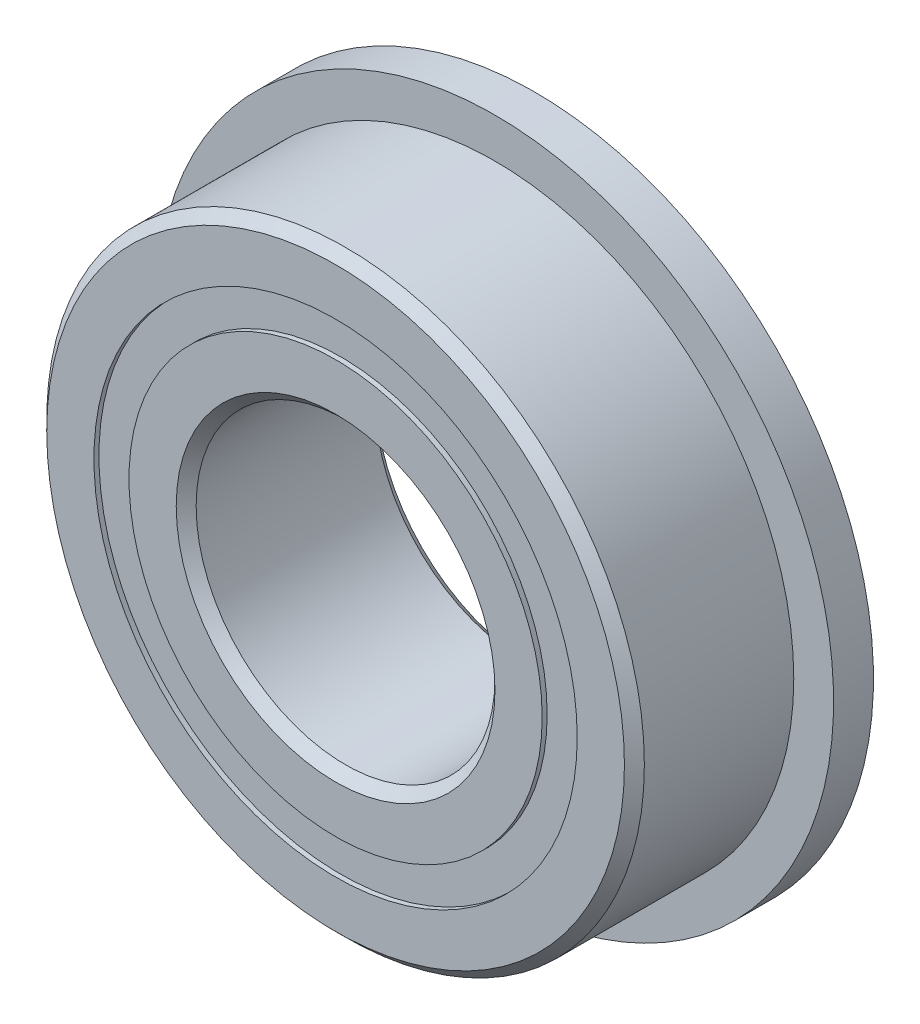
ISO-10303-21;
HEADER;
FILE_DESCRIPTION(('STEP AP214'),'2;1');
FILE_NAME('part.step','',(''),(''),'','','');
FILE_SCHEMA(('AUTOMOTIVE_DESIGN { 1 0 10303 214 1 1 1 1 }'));
ENDSEC;
DATA;
#1=APPLICATION_CONTEXT('core data for automotive mechanical design processes');
#2=APPLICATION_PROTOCOL_DEFINITION('international standard','automotive_design',2000,#1);
#3=PRODUCT_CONTEXT('',#1,'mechanical');
#4=PRODUCT('Part','Part','',(#3));
#5=PRODUCT_RELATED_PRODUCT_CATEGORY('part','',(#4));
#6=PRODUCT_DEFINITION_FORMATION('','',#4);
#7=PRODUCT_DEFINITION_CONTEXT('part definition',#1,'design');
#8=PRODUCT_DEFINITION('design','',#6,#7);
#9=PRODUCT_DEFINITION_SHAPE('','',#8);
#10=(LENGTH_UNIT() NAMED_UNIT(*) SI_UNIT(.MILLI.,.METRE.));
#11=(NAMED_UNIT(*) PLANE_ANGLE_UNIT() SI_UNIT($,.RADIAN.));
#12=(NAMED_UNIT(*) SI_UNIT($,.STERADIAN.) SOLID_ANGLE_UNIT());
#13=UNCERTAINTY_MEASURE_WITH_UNIT(LENGTH_MEASURE(1.E-05),#10,'distance_accuracy_value','');
#14=(GEOMETRIC_REPRESENTATION_CONTEXT(3) GLOBAL_UNCERTAINTY_ASSIGNED_CONTEXT((#13)) GLOBAL_UNIT_ASSIGNED_CONTEXT((#10,
#11,#12)) REPRESENTATION_CONTEXT('',''));
#15=CARTESIAN_POINT('',(0.,0.,0.));
#16=DIRECTION('',(0.,0.,1.));
#17=DIRECTION('',(1.,0.,0.));
#18=AXIS2_PLACEMENT_3D('',#15,#16,#17);
#19=CARTESIAN_POINT('',(0.,4.85164835164835,-1.9));
#20=DIRECTION('',(0.,0.,1.));
#21=DIRECTION('',(1.,0.,0.));
#22=AXIS2_PLACEMENT_3D('',#19,#20,#21);
#23=PLANE('',#22);
#24=CARTESIAN_POINT('',(0.,0.,-1.9));
#25=DIRECTION('',(0.,0.,1.));
#26=DIRECTION('',(1.,0.,0.));
#27=AXIS2_PLACEMENT_3D('',#24,#25,#26);
#28=CIRCLE('',#27,4.85164835164835);
#29=CARTESIAN_POINT('',(4.85164835164835,0.,-1.9));
#30=VERTEX_POINT('',#29);
#31=EDGE_CURVE('E58',#30,#30,#28,.T.);
#32=ORIENTED_EDGE('',*,*,#31,.F.);
#33=EDGE_LOOP('',(#32));
#34=FACE_BOUND('',#33,.T.);
#35=CARTESIAN_POINT('',(0.,0.,-1.9));
#36=DIRECTION('',(0.,0.,1.));
#37=DIRECTION('',(1.,0.,0.));
#38=AXIS2_PLACEMENT_3D('',#35,#36,#37);
#39=CIRCLE('',#38,4.14835164835165);
#40=CARTESIAN_POINT('',(4.14835164835165,0.,-1.9));
#41=VERTEX_POINT('',#40);
#42=EDGE_CURVE('E11',#41,#41,#39,.T.);
#43=ORIENTED_EDGE('',*,*,#42,.T.);
#44=EDGE_LOOP('',(#43));
#45=FACE_BOUND('',#44,.T.);
#46=ADVANCED_FACE('F44',(#34,#45),#23,.F.);
#47=CARTESIAN_POINT('',(0.,0.,2.));
#48=DIRECTION('',(0.,0.,1.));
#49=DIRECTION('',(1.,0.,0.));
#50=AXIS2_PLACEMENT_3D('',#47,#48,#49);
#51=CYLINDRICAL_SURFACE('',#50,4.14835164835165);
#52=ORIENTED_EDGE('',*,*,#42,.F.);
#53=EDGE_LOOP('',(#52));
#54=FACE_BOUND('',#53,.T.);
#55=CARTESIAN_POINT('',(0.,0.,-0.955918417024762));
#56=DIRECTION('',(0.,0.,1.));
#57=DIRECTION('',(1.,0.,0.));
#58=AXIS2_PLACEMENT_3D('',#55,#56,#57);
#59=CIRCLE('',#58,4.14835164835165);
#60=CARTESIAN_POINT('',(4.14835164835165,0.,-0.955918417024762));
#61=VERTEX_POINT('',#60);
#62=EDGE_CURVE('E50',#61,#61,#59,.T.);
#63=ORIENTED_EDGE('',*,*,#62,.T.);
#64=EDGE_LOOP('',(#63));
#65=FACE_BOUND('',#64,.T.);
#66=ADVANCED_FACE('F67',(#54,#65),#51,.F.);
#67=CARTESIAN_POINT('',(0.,4.85164835164835,-0.955918417024762));
#68=DIRECTION('',(0.,0.,-1.));
#69=DIRECTION('',(-1.,0.,0.));
#70=AXIS2_PLACEMENT_3D('',#67,#68,#69);
#71=PLANE('',#70);
#72=ORIENTED_EDGE('',*,*,#62,.F.);
#73=EDGE_LOOP('',(#72));
#74=FACE_BOUND('',#73,.T.);
#75=CARTESIAN_POINT('',(0.,0.,-0.955918417024762));
#76=DIRECTION('',(0.,0.,1.));
#77=DIRECTION('',(1.,0.,0.));
#78=AXIS2_PLACEMENT_3D('',#75,#76,#77);
#79=CIRCLE('',#78,4.85164835164835);
#80=CARTESIAN_POINT('',(4.85164835164835,0.,-0.955918417024762));
#81=VERTEX_POINT('',#80);
#82=EDGE_CURVE('E54',#81,#81,#79,.T.);
#83=ORIENTED_EDGE('',*,*,#82,.T.);
#84=EDGE_LOOP('',(#83));
#85=FACE_BOUND('',#84,.T.);
#86=ADVANCED_FACE('F71',(#74,#85),#71,.F.);
#87=CARTESIAN_POINT('',(0.,0.,2.));
#88=DIRECTION('',(0.,0.,1.));
#89=DIRECTION('',(1.,0.,0.));
#90=AXIS2_PLACEMENT_3D('',#87,#88,#89);
#91=CYLINDRICAL_SURFACE('',#90,4.85164835164835);
#92=ORIENTED_EDGE('',*,*,#82,.F.);
#93=EDGE_LOOP('',(#92));
#94=FACE_BOUND('',#93,.T.);
#95=ORIENTED_EDGE('',*,*,#31,.T.);
#96=EDGE_LOOP('',(#95));
#97=FACE_BOUND('',#96,.T.);
#98=ADVANCED_FACE('F64',(#94,#97),#91,.T.);
#99=CLOSED_SHELL('',(#46,#66,#86,#98));
#100=MANIFOLD_SOLID_BREP('B2',#99);
#101=CARTESIAN_POINT('',(0.,4.85164835164835,1.9));
#102=DIRECTION('',(0.,0.,-1.));
#103=DIRECTION('',(-1.,0.,0.));
#104=AXIS2_PLACEMENT_3D('',#101,#102,#103);
#105=PLANE('',#104);
#106=CARTESIAN_POINT('',(0.,0.,1.9));
#107=DIRECTION('',(0.,0.,1.));
#108=DIRECTION('',(1.,0.,0.));
#109=AXIS2_PLACEMENT_3D('',#106,#107,#108);
#110=CIRCLE('',#109,4.14835164835165);
#111=CARTESIAN_POINT('',(4.14835164835165,0.,1.9));
#112=VERTEX_POINT('',#111);
#113=EDGE_CURVE('E43',#112,#112,#110,.T.);
#114=ORIENTED_EDGE('',*,*,#113,.F.);
#115=EDGE_LOOP('',(#114));
#116=FACE_BOUND('',#115,.T.);
#117=CARTESIAN_POINT('',(0.,0.,1.9));
#118=DIRECTION('',(0.,0.,1.));
#119=DIRECTION('',(1.,0.,0.));
#120=AXIS2_PLACEMENT_3D('',#117,#118,#119);
#121=CIRCLE('',#120,4.85164835164835);
#122=CARTESIAN_POINT('',(4.85164835164835,0.,1.9));
#123=VERTEX_POINT('',#122);
#124=EDGE_CURVE('E126',#123,#123,#121,.T.);
#125=ORIENTED_EDGE('',*,*,#124,.T.);
#126=EDGE_LOOP('',(#125));
#127=FACE_BOUND('',#126,.T.);
#128=ADVANCED_FACE('F112',(#116,#127),#105,.F.);
#129=CARTESIAN_POINT('',(0.,0.,2.));
#130=DIRECTION('',(0.,0.,1.));
#131=DIRECTION('',(1.,0.,0.));
#132=AXIS2_PLACEMENT_3D('',#129,#130,#131);
#133=CYLINDRICAL_SURFACE('',#132,4.14835164835165);
#134=CARTESIAN_POINT('',(0.,0.,0.955918417024761));
#135=DIRECTION('',(0.,0.,1.));
#136=DIRECTION('',(1.,0.,0.));
#137=AXIS2_PLACEMENT_3D('',#134,#135,#136);
#138=CIRCLE('',#137,4.14835164835165);
#139=CARTESIAN_POINT('',(4.14835164835165,0.,0.955918417024761));
#140=VERTEX_POINT('',#139);
#141=EDGE_CURVE('E118',#140,#140,#138,.T.);
#142=ORIENTED_EDGE('',*,*,#141,.F.);
#143=EDGE_LOOP('',(#142));
#144=FACE_BOUND('',#143,.T.);
#145=ORIENTED_EDGE('',*,*,#113,.T.);
#146=EDGE_LOOP('',(#145));
#147=FACE_BOUND('',#146,.T.);
#148=ADVANCED_FACE('F141',(#144,#147),#133,.F.);
#149=CARTESIAN_POINT('',(0.,4.85164835164835,0.955918417024761));
#150=DIRECTION('',(0.,0.,1.));
#151=DIRECTION('',(1.,0.,0.));
#152=AXIS2_PLACEMENT_3D('',#149,#150,#151);
#153=PLANE('',#152);
#154=CARTESIAN_POINT('',(0.,0.,0.955918417024761));
#155=DIRECTION('',(0.,0.,1.));
#156=DIRECTION('',(1.,0.,0.));
#157=AXIS2_PLACEMENT_3D('',#154,#155,#156);
#158=CIRCLE('',#157,4.85164835164835);
#159=CARTESIAN_POINT('',(4.85164835164835,0.,0.955918417024761));
#160=VERTEX_POINT('',#159);
#161=EDGE_CURVE('E122',#160,#160,#158,.T.);
#162=ORIENTED_EDGE('',*,*,#161,.F.);
#163=EDGE_LOOP('',(#162));
#164=FACE_BOUND('',#163,.T.);
#165=ORIENTED_EDGE('',*,*,#141,.T.);
#166=EDGE_LOOP('',(#165));
#167=FACE_BOUND('',#166,.T.);
#168=ADVANCED_FACE('F136',(#164,#167),#153,.F.);
#169=CARTESIAN_POINT('',(0.,0.,2.));
#170=DIRECTION('',(0.,0.,1.));
#171=DIRECTION('',(1.,0.,0.));
#172=AXIS2_PLACEMENT_3D('',#169,#170,#171);
#173=CYLINDRICAL_SURFACE('',#172,4.85164835164835);
#174=ORIENTED_EDGE('',*,*,#124,.F.);
#175=EDGE_LOOP('',(#174));
#176=FACE_BOUND('',#175,.T.);
#177=ORIENTED_EDGE('',*,*,#161,.T.);
#178=EDGE_LOOP('',(#177));
#179=FACE_BOUND('',#178,.T.);
#180=ADVANCED_FACE('F133',(#176,#179),#173,.T.);
#181=CLOSED_SHELL('',(#128,#148,#168,#180));
#182=MANIFOLD_SOLID_BREP('B6',#181);
#183=CARTESIAN_POINT('',(-2.24999999999995,3.89711431703,0.));
#184=DIRECTION('',(0.,0.,1.));
#185=DIRECTION('',(-0.499999999999989,0.866025403784445,0.));
#186=AXIS2_PLACEMENT_3D('',#183,#184,#185);
#187=SPHERICAL_SURFACE('',#186,0.955918417024761);
#188=CARTESIAN_POINT('',(-2.24999999999995,3.89711431703,0.955918417024761));
#189=VERTEX_POINT('',#188);
#190=VERTEX_LOOP('',#189);
#191=FACE_BOUND('',#190,.T.);
#192=ADVANCED_FACE('F180',(#191),#187,.T.);
#193=CLOSED_SHELL('',(#192));
#194=MANIFOLD_SOLID_BREP('B38',#193);
#195=CARTESIAN_POINT('',(-3.89711431702995,2.25000000000005,0.));
#196=DIRECTION('',(0.,0.,1.));
#197=DIRECTION('',(-0.866025403784433,0.50000000000001,0.));
#198=AXIS2_PLACEMENT_3D('',#195,#196,#197);
#199=SPHERICAL_SURFACE('',#198,0.955918417024761);
#200=CARTESIAN_POINT('',(-3.89711431702995,2.25000000000005,0.955918417024761));
#201=VERTEX_POINT('',#200);
#202=VERTEX_LOOP('',#201);
#203=FACE_BOUND('',#202,.T.);
#204=ADVANCED_FACE('F201',(#203),#199,.T.);
#205=CLOSED_SHELL('',(#204));
#206=MANIFOLD_SOLID_BREP('B108',#205);
#207=CARTESIAN_POINT('',(-4.5,0.,0.));
#208=DIRECTION('',(0.,0.,1.));
#209=DIRECTION('',(-1.,0.,0.));
#210=AXIS2_PLACEMENT_3D('',#207,#208,#209);
#211=SPHERICAL_SURFACE('',#210,0.955918417024761);
#212=CARTESIAN_POINT('',(-4.5,0.,0.955918417024761));
#213=VERTEX_POINT('',#212);
#214=VERTEX_LOOP('',#213);
#215=FACE_BOUND('',#214,.T.);
#216=ADVANCED_FACE('F222',(#215),#211,.T.);
#217=CLOSED_SHELL('',(#216));
#218=MANIFOLD_SOLID_BREP('B176',#217);
#219=CARTESIAN_POINT('',(-3.89711431703,-2.24999999999996,0.));
#220=DIRECTION('',(0.,0.,1.));
#221=DIRECTION('',(-0.866025403784443,-0.499999999999992,0.));
#222=AXIS2_PLACEMENT_3D('',#219,#220,#221);
#223=SPHERICAL_SURFACE('',#222,0.955918417024761);
#224=CARTESIAN_POINT('',(-3.89711431703,-2.24999999999996,0.955918417024761));
#225=VERTEX_POINT('',#224);
#226=VERTEX_LOOP('',#225);
#227=FACE_BOUND('',#226,.T.);
#228=ADVANCED_FACE('F243',(#227),#223,.T.);
#229=CLOSED_SHELL('',(#228));
#230=MANIFOLD_SOLID_BREP('B197',#229);
#231=CARTESIAN_POINT('',(-2.25000000000003,-3.89711431702996,0.));
#232=DIRECTION('',(0.,0.,1.));
#233=DIRECTION('',(-0.500000000000007,-0.866025403784435,0.));
#234=AXIS2_PLACEMENT_3D('',#231,#232,#233);
#235=SPHERICAL_SURFACE('',#234,0.955918417024761);
#236=CARTESIAN_POINT('',(-2.25000000000003,-3.89711431702996,0.955918417024761));
#237=VERTEX_POINT('',#236);
#238=VERTEX_LOOP('',#237);
#239=FACE_BOUND('',#238,.T.);
#240=ADVANCED_FACE('F264',(#239),#235,.T.);
#241=CLOSED_SHELL('',(#240));
#242=MANIFOLD_SOLID_BREP('B218',#241);
#243=CARTESIAN_POINT('',(0.,-4.5,0.));
#244=DIRECTION('',(0.,0.,1.));
#245=DIRECTION('',(0.,-1.,0.));
#246=AXIS2_PLACEMENT_3D('',#243,#244,#245);
#247=SPHERICAL_SURFACE('',#246,0.955918417024761);
#248=CARTESIAN_POINT('',(0.,-4.5,0.955918417024761));
#249=VERTEX_POINT('',#248);
#250=VERTEX_LOOP('',#249);
#251=FACE_BOUND('',#250,.T.);
#252=ADVANCED_FACE('F285',(#251),#247,.T.);
#253=CLOSED_SHELL('',(#252));
#254=MANIFOLD_SOLID_BREP('B239',#253);
#255=CARTESIAN_POINT('',(2.24999999999998,-3.89711431702999,0.));
#256=DIRECTION('',(0.,0.,1.));
#257=DIRECTION('',(0.499999999999995,-0.866025403784442,0.));
#258=AXIS2_PLACEMENT_3D('',#255,#256,#257);
#259=SPHERICAL_SURFACE('',#258,0.955918417024761);
#260=CARTESIAN_POINT('',(2.24999999999998,-3.89711431702999,0.955918417024761));
#261=VERTEX_POINT('',#260);
#262=VERTEX_LOOP('',#261);
#263=FACE_BOUND('',#262,.T.);
#264=ADVANCED_FACE('F306',(#263),#259,.T.);
#265=CLOSED_SHELL('',(#264));
#266=MANIFOLD_SOLID_BREP('B260',#265);
#267=CARTESIAN_POINT('',(3.89711431702996,-2.25000000000002,0.));
#268=DIRECTION('',(0.,0.,1.));
#269=DIRECTION('',(0.866025403784436,-0.500000000000004,0.));
#270=AXIS2_PLACEMENT_3D('',#267,#268,#269);
#271=SPHERICAL_SURFACE('',#270,0.955918417024761);
#272=CARTESIAN_POINT('',(3.89711431702996,-2.25000000000002,0.955918417024761));
#273=VERTEX_POINT('',#272);
#274=VERTEX_LOOP('',#273);
#275=FACE_BOUND('',#274,.T.);
#276=ADVANCED_FACE('F327',(#275),#271,.T.);
#277=CLOSED_SHELL('',(#276));
#278=MANIFOLD_SOLID_BREP('B281',#277);
#279=CARTESIAN_POINT('',(4.5,0.,0.));
#280=DIRECTION('',(0.,0.,1.));
#281=DIRECTION('',(1.,0.,0.));
#282=AXIS2_PLACEMENT_3D('',#279,#280,#281);
#283=SPHERICAL_SURFACE('',#282,0.955918417024761);
#284=CARTESIAN_POINT('',(4.5,0.,0.955918417024761));
#285=VERTEX_POINT('',#284);
#286=VERTEX_LOOP('',#285);
#287=FACE_BOUND('',#286,.T.);
#288=ADVANCED_FACE('F348',(#287),#283,.T.);
#289=CLOSED_SHELL('',(#288));
#290=MANIFOLD_SOLID_BREP('B302',#289);
#291=CARTESIAN_POINT('',(3.89711431702998,2.24999999999999,0.));
#292=DIRECTION('',(0.,0.,1.));
#293=DIRECTION('',(0.86602540378444,0.499999999999998,0.));
#294=AXIS2_PLACEMENT_3D('',#291,#292,#293);
#295=SPHERICAL_SURFACE('',#294,0.955918417024761);
#296=CARTESIAN_POINT('',(3.89711431702998,2.24999999999999,0.955918417024761));
#297=VERTEX_POINT('',#296);
#298=VERTEX_LOOP('',#297);
#299=FACE_BOUND('',#298,.T.);
#300=ADVANCED_FACE('F369',(#299),#295,.T.);
#301=CLOSED_SHELL('',(#300));
#302=MANIFOLD_SOLID_BREP('B323',#301);
#303=CARTESIAN_POINT('',(2.25,3.89711431702997,0.));
#304=DIRECTION('',(0.,0.,1.));
#305=DIRECTION('',(0.500000000000001,0.866025403784438,0.));
#306=AXIS2_PLACEMENT_3D('',#303,#304,#305);
#307=SPHERICAL_SURFACE('',#306,0.955918417024761);
#308=CARTESIAN_POINT('',(2.25,3.89711431702997,0.955918417024761));
#309=VERTEX_POINT('',#308);
#310=VERTEX_LOOP('',#309);
#311=FACE_BOUND('',#310,.T.);
#312=ADVANCED_FACE('F390',(#311),#307,.T.);
#313=CLOSED_SHELL('',(#312));
#314=MANIFOLD_SOLID_BREP('B344',#313);
#315=CARTESIAN_POINT('',(0.,4.5,0.));
#316=DIRECTION('',(0.,0.,1.));
#317=DIRECTION('',(0.,1.,0.));
#318=AXIS2_PLACEMENT_3D('',#315,#316,#317);
#319=SPHERICAL_SURFACE('',#318,0.955918417024761);
#320=CARTESIAN_POINT('',(0.,4.5,0.955918417024761));
#321=VERTEX_POINT('',#320);
#322=VERTEX_LOOP('',#321);
#323=FACE_BOUND('',#322,.T.);
#324=ADVANCED_FACE('F413',(#323),#319,.T.);
#325=CLOSED_SHELL('',(#324));
#326=MANIFOLD_SOLID_BREP('B365',#325);
#327=CARTESIAN_POINT('',(0.,4.14835164835165,2.));
#328=DIRECTION('',(0.,0.,-1.));
#329=DIRECTION('',(-1.,0.,0.));
#330=AXIS2_PLACEMENT_3D('',#327,#328,#329);
#331=PLANE('',#330);
#332=CARTESIAN_POINT('',(0.,0.,2.));
#333=DIRECTION('',(0.,0.,1.));
#334=DIRECTION('',(1.,0.,0.));
#335=AXIS2_PLACEMENT_3D('',#332,#333,#334);
#336=CIRCLE('',#335,3.2);
#337=CARTESIAN_POINT('',(3.2,0.,2.));
#338=VERTEX_POINT('',#337);
#339=EDGE_CURVE('E461',#338,#338,#336,.T.);
#340=ORIENTED_EDGE('',*,*,#339,.F.);
#341=EDGE_LOOP('',(#340));
#342=FACE_BOUND('',#341,.T.);
#343=CARTESIAN_POINT('',(0.,0.,2.));
#344=DIRECTION('',(0.,0.,1.));
#345=DIRECTION('',(1.,0.,0.));
#346=AXIS2_PLACEMENT_3D('',#343,#344,#345);
#347=CIRCLE('',#346,4.14835164835165);
#348=CARTESIAN_POINT('',(4.14835164835165,0.,2.));
#349=VERTEX_POINT('',#348);
#350=EDGE_CURVE('E412',#349,#349,#347,.T.);
#351=ORIENTED_EDGE('',*,*,#350,.T.);
#352=EDGE_LOOP('',(#351));
#353=FACE_BOUND('',#352,.T.);
#354=ADVANCED_FACE('F433',(#342,#353),#331,.F.);
#355=CARTESIAN_POINT('',(0.,0.,2.));
#356=DIRECTION('',(0.,0.,1.));
#357=DIRECTION('',(1.,0.,0.));
#358=AXIS2_PLACEMENT_3D('',#355,#356,#357);
#359=CYLINDRICAL_SURFACE('',#358,4.14835164835165);
#360=ORIENTED_EDGE('',*,*,#350,.F.);
#361=EDGE_LOOP('',(#360));
#362=FACE_BOUND('',#361,.T.);
#363=CARTESIAN_POINT('',(0.,0.,0.888888888888888));
#364=DIRECTION('',(0.,0.,1.));
#365=DIRECTION('',(1.,0.,0.));
#366=AXIS2_PLACEMENT_3D('',#363,#364,#365);
#367=CIRCLE('',#366,4.14835164835165);
#368=CARTESIAN_POINT('',(4.14835164835165,0.,0.888888888888888));
#369=VERTEX_POINT('',#368);
#370=EDGE_CURVE('E439',#369,#369,#367,.T.);
#371=ORIENTED_EDGE('',*,*,#370,.T.);
#372=EDGE_LOOP('',(#371));
#373=FACE_BOUND('',#372,.T.);
#374=ADVANCED_FACE('F468',(#362,#373),#359,.T.);
#375=CARTESIAN_POINT('',(0.,0.,0.));
#376=DIRECTION('',(0.,0.,1.));
#377=DIRECTION('',(1.,0.,0.));
#378=AXIS2_PLACEMENT_3D('',#375,#376,#377);
#379=TOROIDAL_SURFACE('',#378,4.5,0.95591841702476);
#380=ORIENTED_EDGE('',*,*,#370,.F.);
#381=EDGE_LOOP('',(#380));
#382=FACE_BOUND('',#381,.T.);
#383=CARTESIAN_POINT('',(0.,0.,-0.88888888888889));
#384=DIRECTION('',(0.,0.,1.));
#385=DIRECTION('',(1.,0.,0.));
#386=AXIS2_PLACEMENT_3D('',#383,#384,#385);
#387=CIRCLE('',#386,4.14835164835165);
#388=CARTESIAN_POINT('',(4.14835164835165,0.,-0.88888888888889));
#389=VERTEX_POINT('',#388);
#390=EDGE_CURVE('E443',#389,#389,#387,.T.);
#391=ORIENTED_EDGE('',*,*,#390,.T.);
#392=EDGE_LOOP('',(#391));
#393=FACE_BOUND('',#392,.T.);
#394=ADVANCED_FACE('F472',(#382,#393),#379,.F.);
#395=CARTESIAN_POINT('',(0.,0.,2.));
#396=DIRECTION('',(0.,0.,1.));
#397=DIRECTION('',(1.,0.,0.));
#398=AXIS2_PLACEMENT_3D('',#395,#396,#397);
#399=CYLINDRICAL_SURFACE('',#398,4.14835164835165);
#400=ORIENTED_EDGE('',*,*,#390,.F.);
#401=EDGE_LOOP('',(#400));
#402=FACE_BOUND('',#401,.T.);
#403=CARTESIAN_POINT('',(0.,0.,-2.));
#404=DIRECTION('',(0.,0.,1.));
#405=DIRECTION('',(1.,0.,0.));
#406=AXIS2_PLACEMENT_3D('',#403,#404,#405);
#407=CIRCLE('',#406,4.14835164835165);
#408=CARTESIAN_POINT('',(4.14835164835165,0.,-2.));
#409=VERTEX_POINT('',#408);
#410=EDGE_CURVE('E447',#409,#409,#407,.T.);
#411=ORIENTED_EDGE('',*,*,#410,.T.);
#412=EDGE_LOOP('',(#411));
#413=FACE_BOUND('',#412,.T.);
#414=ADVANCED_FACE('F477',(#402,#413),#399,.T.);
#415=CARTESIAN_POINT('',(0.,3.2,-2.));
#416=DIRECTION('',(0.,0.,1.));
#417=DIRECTION('',(1.,0.,0.));
#418=AXIS2_PLACEMENT_3D('',#415,#416,#417);
#419=PLANE('',#418);
#420=ORIENTED_EDGE('',*,*,#410,.F.);
#421=EDGE_LOOP('',(#420));
#422=FACE_BOUND('',#421,.T.);
#423=CARTESIAN_POINT('',(0.,0.,-2.));
#424=DIRECTION('',(0.,0.,1.));
#425=DIRECTION('',(1.,0.,0.));
#426=AXIS2_PLACEMENT_3D('',#423,#424,#425);
#427=CIRCLE('',#426,3.2);
#428=CARTESIAN_POINT('',(3.2,0.,-2.));
#429=VERTEX_POINT('',#428);
#430=EDGE_CURVE('E452',#429,#429,#427,.T.);
#431=ORIENTED_EDGE('',*,*,#430,.T.);
#432=EDGE_LOOP('',(#431));
#433=FACE_BOUND('',#432,.T.);
#434=ADVANCED_FACE('F483',(#422,#433),#419,.F.);
#435=CARTESIAN_POINT('',(0.,0.,-1.8));
#436=DIRECTION('',(0.,0.,-1.));
#437=DIRECTION('',(-1.,0.,0.));
#438=AXIS2_PLACEMENT_3D('',#435,#436,#437);
#439=CONICAL_SURFACE('',#438,3.,0.785398163397443);
#440=ORIENTED_EDGE('',*,*,#430,.F.);
#441=EDGE_LOOP('',(#440));
#442=FACE_BOUND('',#441,.T.);
#443=CARTESIAN_POINT('',(0.,0.,-1.8));
#444=DIRECTION('',(0.,0.,1.));
#445=DIRECTION('',(1.,0.,0.));
#446=AXIS2_PLACEMENT_3D('',#443,#444,#445);
#447=CIRCLE('',#446,3.);
#448=CARTESIAN_POINT('',(3.,0.,-1.8));
#449=VERTEX_POINT('',#448);
#450=EDGE_CURVE('E455',#449,#449,#447,.T.);
#451=ORIENTED_EDGE('',*,*,#450,.T.);
#452=EDGE_LOOP('',(#451));
#453=FACE_BOUND('',#452,.T.);
#454=ADVANCED_FACE('F487',(#442,#453),#439,.F.);
#455=CARTESIAN_POINT('',(0.,0.,2.));
#456=DIRECTION('',(0.,0.,1.));
#457=DIRECTION('',(1.,0.,0.));
#458=AXIS2_PLACEMENT_3D('',#455,#456,#457);
#459=CYLINDRICAL_SURFACE('',#458,3.);
#460=ORIENTED_EDGE('',*,*,#450,.F.);
#461=EDGE_LOOP('',(#460));
#462=FACE_BOUND('',#461,.T.);
#463=CARTESIAN_POINT('',(0.,0.,1.8));
#464=DIRECTION('',(0.,0.,1.));
#465=DIRECTION('',(1.,0.,0.));
#466=AXIS2_PLACEMENT_3D('',#463,#464,#465);
#467=CIRCLE('',#466,3.);
#468=CARTESIAN_POINT('',(3.,0.,1.8));
#469=VERTEX_POINT('',#468);
#470=EDGE_CURVE('E458',#469,#469,#467,.T.);
#471=ORIENTED_EDGE('',*,*,#470,.T.);
#472=EDGE_LOOP('',(#471));
#473=FACE_BOUND('',#472,.T.);
#474=ADVANCED_FACE('F491',(#462,#473),#459,.F.);
#475=CARTESIAN_POINT('',(0.,0.,2.));
#476=DIRECTION('',(0.,0.,1.));
#477=DIRECTION('',(1.,0.,0.));
#478=AXIS2_PLACEMENT_3D('',#475,#476,#477);
#479=CONICAL_SURFACE('',#478,3.2,0.78539816339745);
#480=ORIENTED_EDGE('',*,*,#470,.F.);
#481=EDGE_LOOP('',(#480));
#482=FACE_BOUND('',#481,.T.);
#483=ORIENTED_EDGE('',*,*,#339,.T.);
#484=EDGE_LOOP('',(#483));
#485=FACE_BOUND('',#484,.T.);
#486=ADVANCED_FACE('F465',(#482,#485),#479,.F.);
#487=CLOSED_SHELL('',(#354,#374,#394,#414,#434,#454,#474,#486));
#488=MANIFOLD_SOLID_BREP('B386',#487);
#489=CARTESIAN_POINT('',(0.,0.,1.8));
#490=DIRECTION('',(0.,0.,-1.));
#491=DIRECTION('',(-1.,0.,0.));
#492=AXIS2_PLACEMENT_3D('',#489,#490,#491);
#493=CONICAL_SURFACE('',#492,6.,0.785398163397447);
#494=CARTESIAN_POINT('',(0.,0.,2.));
#495=DIRECTION('',(0.,0.,1.));
#496=DIRECTION('',(1.,0.,0.));
#497=AXIS2_PLACEMENT_3D('',#494,#495,#496);
#498=CIRCLE('',#497,5.8);
#499=CARTESIAN_POINT('',(5.8,0.,2.));
#500=VERTEX_POINT('',#499);
#501=EDGE_CURVE('E577',#500,#500,#498,.T.);
#502=ORIENTED_EDGE('',*,*,#501,.F.);
#503=EDGE_LOOP('',(#502));
#504=FACE_BOUND('',#503,.T.);
#505=CARTESIAN_POINT('',(0.,0.,1.8));
#506=DIRECTION('',(0.,0.,1.));
#507=DIRECTION('',(1.,0.,0.));
#508=AXIS2_PLACEMENT_3D('',#505,#506,#507);
#509=CIRCLE('',#508,6.);
#510=CARTESIAN_POINT('',(6.,0.,1.8));
#511=VERTEX_POINT('',#510);
#512=EDGE_CURVE('E432',#511,#511,#509,.T.);
#513=ORIENTED_EDGE('',*,*,#512,.T.);
#514=EDGE_LOOP('',(#513));
#515=FACE_BOUND('',#514,.T.);
#516=ADVANCED_FACE('F555',(#504,#515),#493,.T.);
#517=CARTESIAN_POINT('',(0.,0.,2.));
#518=DIRECTION('',(0.,0.,1.));
#519=DIRECTION('',(1.,0.,0.));
#520=AXIS2_PLACEMENT_3D('',#517,#518,#519);
#521=CYLINDRICAL_SURFACE('',#520,6.);
#522=CARTESIAN_POINT('',(0.,0.,-1.2));
#523=DIRECTION('',(0.,0.,1.));
#524=DIRECTION('',(1.,0.,0.));
#525=AXIS2_PLACEMENT_3D('',#522,#523,#524);
#526=CIRCLE('',#525,6.);
#527=CARTESIAN_POINT('',(6.,0.,-1.2));
#528=VERTEX_POINT('',#527);
#529=EDGE_CURVE('E580',#528,#528,#526,.T.);
#530=ORIENTED_EDGE('',*,*,#529,.T.);
#531=EDGE_LOOP('',(#530));
#532=FACE_BOUND('',#531,.T.);
#533=ORIENTED_EDGE('',*,*,#512,.F.);
#534=EDGE_LOOP('',(#533));
#535=FACE_BOUND('',#534,.T.);
#536=ADVANCED_FACE('F600',(#532,#535),#521,.T.);
#537=CARTESIAN_POINT('',(0.,5.8,-2.));
#538=DIRECTION('',(0.,0.,1.));
#539=DIRECTION('',(1.,0.,0.));
#540=AXIS2_PLACEMENT_3D('',#537,#538,#539);
#541=PLANE('',#540);
#542=CARTESIAN_POINT('',(0.,0.,-2.));
#543=DIRECTION('',(0.,0.,1.));
#544=DIRECTION('',(1.,0.,0.));
#545=AXIS2_PLACEMENT_3D('',#542,#543,#544);
#546=CIRCLE('',#545,4.85164835164835);
#547=CARTESIAN_POINT('',(4.85164835164835,0.,-2.));
#548=VERTEX_POINT('',#547);
#549=EDGE_CURVE('E561',#548,#548,#546,.T.);
#550=ORIENTED_EDGE('',*,*,#549,.T.);
#551=EDGE_LOOP('',(#550));
#552=FACE_BOUND('',#551,.T.);
#553=CARTESIAN_POINT('',(0.,0.,-2.));
#554=DIRECTION('',(0.,0.,-1.));
#555=DIRECTION('',(-1.,0.,0.));
#556=AXIS2_PLACEMENT_3D('',#553,#554,#555);
#557=CIRCLE('',#556,6.8);
#558=CARTESIAN_POINT('',(-6.8,0.,-2.));
#559=VERTEX_POINT('',#558);
#560=EDGE_CURVE('E583',#559,#559,#557,.T.);
#561=ORIENTED_EDGE('',*,*,#560,.T.);
#562=EDGE_LOOP('',(#561));
#563=FACE_BOUND('',#562,.T.);
#564=ADVANCED_FACE('F603',(#552,#563),#541,.F.);
#565=CARTESIAN_POINT('',(0.,0.,2.));
#566=DIRECTION('',(0.,0.,1.));
#567=DIRECTION('',(1.,0.,0.));
#568=AXIS2_PLACEMENT_3D('',#565,#566,#567);
#569=CYLINDRICAL_SURFACE('',#568,4.85164835164835);
#570=CARTESIAN_POINT('',(0.,0.,-0.888888888888889));
#571=DIRECTION('',(0.,0.,1.));
#572=DIRECTION('',(1.,0.,0.));
#573=AXIS2_PLACEMENT_3D('',#570,#571,#572);
#574=CIRCLE('',#573,4.85164835164835);
#575=CARTESIAN_POINT('',(4.85164835164835,0.,-0.888888888888889));
#576=VERTEX_POINT('',#575);
#577=EDGE_CURVE('E565',#576,#576,#574,.T.);
#578=ORIENTED_EDGE('',*,*,#577,.T.);
#579=EDGE_LOOP('',(#578));
#580=FACE_BOUND('',#579,.T.);
#581=ORIENTED_EDGE('',*,*,#549,.F.);
#582=EDGE_LOOP('',(#581));
#583=FACE_BOUND('',#582,.T.);
#584=ADVANCED_FACE('F608',(#580,#583),#569,.F.);
#585=CARTESIAN_POINT('',(0.,0.,0.));
#586=DIRECTION('',(0.,0.,1.));
#587=DIRECTION('',(1.,0.,0.));
#588=AXIS2_PLACEMENT_3D('',#585,#586,#587);
#589=TOROIDAL_SURFACE('',#588,4.5,0.955918417024761);
#590=ORIENTED_EDGE('',*,*,#577,.F.);
#591=EDGE_LOOP('',(#590));
#592=FACE_BOUND('',#591,.T.);
#593=CARTESIAN_POINT('',(0.,0.,0.888888888888889));
#594=DIRECTION('',(0.,0.,1.));
#595=DIRECTION('',(1.,0.,0.));
#596=AXIS2_PLACEMENT_3D('',#593,#594,#595);
#597=CIRCLE('',#596,4.85164835164835);
#598=CARTESIAN_POINT('',(4.85164835164835,0.,0.888888888888889));
#599=VERTEX_POINT('',#598);
#600=EDGE_CURVE('E569',#599,#599,#597,.T.);
#601=ORIENTED_EDGE('',*,*,#600,.T.);
#602=EDGE_LOOP('',(#601));
#603=FACE_BOUND('',#602,.T.);
#604=ADVANCED_FACE('F614',(#592,#603),#589,.F.);
#605=CARTESIAN_POINT('',(0.,0.,2.));
#606=DIRECTION('',(0.,0.,1.));
#607=DIRECTION('',(1.,0.,0.));
#608=AXIS2_PLACEMENT_3D('',#605,#606,#607);
#609=CYLINDRICAL_SURFACE('',#608,4.85164835164835);
#610=ORIENTED_EDGE('',*,*,#600,.F.);
#611=EDGE_LOOP('',(#610));
#612=FACE_BOUND('',#611,.T.);
#613=CARTESIAN_POINT('',(0.,0.,2.));
#614=DIRECTION('',(0.,0.,1.));
#615=DIRECTION('',(1.,0.,0.));
#616=AXIS2_PLACEMENT_3D('',#613,#614,#615);
#617=CIRCLE('',#616,4.85164835164835);
#618=CARTESIAN_POINT('',(4.85164835164835,0.,2.));
#619=VERTEX_POINT('',#618);
#620=EDGE_CURVE('E574',#619,#619,#617,.T.);
#621=ORIENTED_EDGE('',*,*,#620,.T.);
#622=EDGE_LOOP('',(#621));
#623=FACE_BOUND('',#622,.T.);
#624=ADVANCED_FACE('F618',(#612,#623),#609,.F.);
#625=CARTESIAN_POINT('',(0.,5.8,2.));
#626=DIRECTION('',(0.,0.,-1.));
#627=DIRECTION('',(-1.,0.,0.));
#628=AXIS2_PLACEMENT_3D('',#625,#626,#627);
#629=PLANE('',#628);
#630=ORIENTED_EDGE('',*,*,#620,.F.);
#631=EDGE_LOOP('',(#630));
#632=FACE_BOUND('',#631,.T.);
#633=ORIENTED_EDGE('',*,*,#501,.T.);
#634=EDGE_LOOP('',(#633));
#635=FACE_BOUND('',#634,.T.);
#636=ADVANCED_FACE('F596',(#632,#635),#629,.F.);
#637=CARTESIAN_POINT('',(0.,4.85164835164835,-1.2));
#638=DIRECTION('',(0.,0.,1.));
#639=DIRECTION('',(1.,0.,0.));
#640=AXIS2_PLACEMENT_3D('',#637,#638,#639);
#641=PLANE('',#640);
#642=CARTESIAN_POINT('',(0.,0.,-1.2));
#643=DIRECTION('',(0.,0.,-1.));
#644=DIRECTION('',(-1.,0.,0.));
#645=AXIS2_PLACEMENT_3D('',#642,#643,#644);
#646=CIRCLE('',#645,6.8);
#647=CARTESIAN_POINT('',(-6.8,0.,-1.2));
#648=VERTEX_POINT('',#647);
#649=EDGE_CURVE('E586',#648,#648,#646,.T.);
#650=ORIENTED_EDGE('',*,*,#649,.F.);
#651=EDGE_LOOP('',(#650));
#652=FACE_BOUND('',#651,.T.);
#653=ORIENTED_EDGE('',*,*,#529,.F.);
#654=EDGE_LOOP('',(#653));
#655=FACE_BOUND('',#654,.T.);
#656=ADVANCED_FACE('F593',(#652,#655),#641,.T.);
#657=CARTESIAN_POINT('',(0.,0.,-2.));
#658=DIRECTION('',(0.,0.,-1.));
#659=DIRECTION('',(-1.,0.,0.));
#660=AXIS2_PLACEMENT_3D('',#657,#658,#659);
#661=CYLINDRICAL_SURFACE('',#660,6.8);
#662=ORIENTED_EDGE('',*,*,#649,.T.);
#663=EDGE_LOOP('',(#662));
#664=FACE_BOUND('',#663,.T.);
#665=ORIENTED_EDGE('',*,*,#560,.F.);
#666=EDGE_LOOP('',(#665));
#667=FACE_BOUND('',#666,.T.);
#668=ADVANCED_FACE('F590',(#664,#667),#661,.T.);
#669=CLOSED_SHELL('',(#516,#536,#564,#584,#604,#624,#636,#656,#668));
#670=MANIFOLD_SOLID_BREP('B407',#669);
#671=ADVANCED_BREP_SHAPE_REPRESENTATION('',(#18,#100,#182,#194,#206,#218,#230,#242,#254,#266,
#278,#290,#302,#314,#326,#488,#670),#14);
#672=SHAPE_DEFINITION_REPRESENTATION(#9,#671);
ENDSEC;
END-ISO-10303-21;
